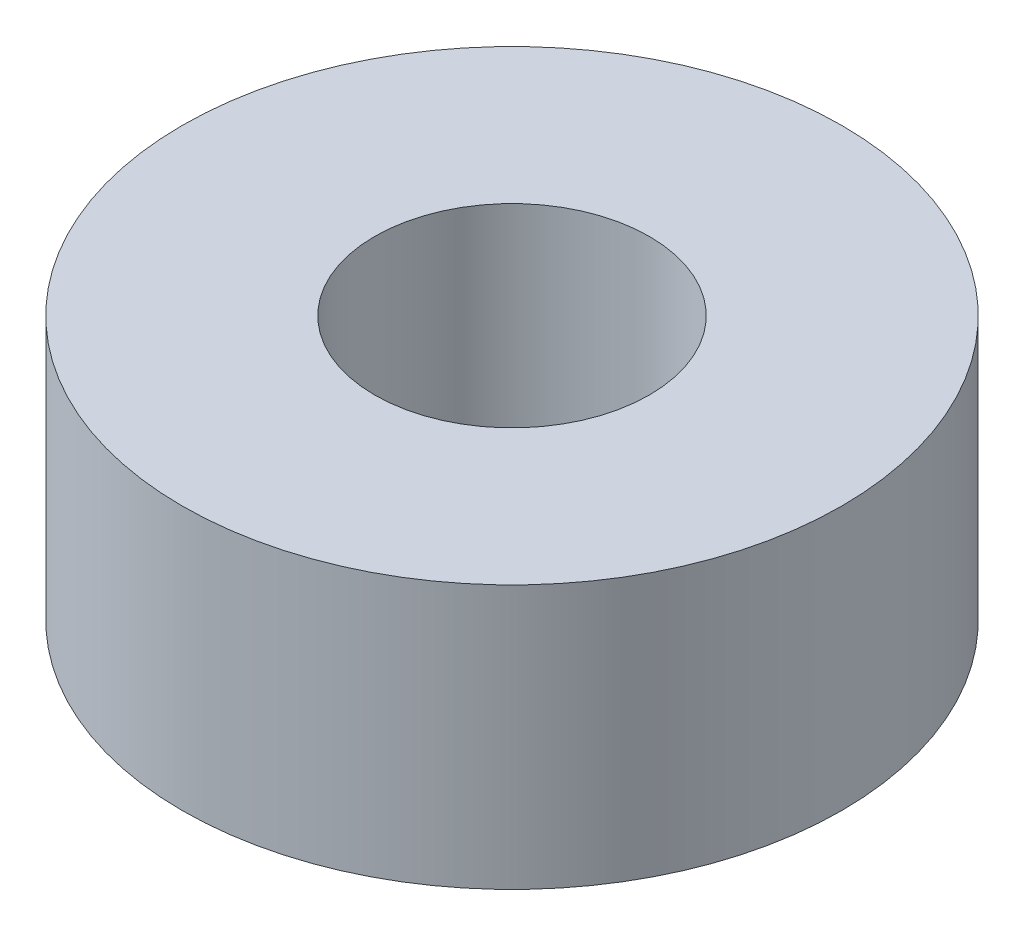
ISO-10303-21;
HEADER;
FILE_DESCRIPTION(('STEP AP214'),'2;1');
FILE_NAME('part.step','',(''),(''),'','','');
FILE_SCHEMA(('AUTOMOTIVE_DESIGN { 1 0 10303 214 1 1 1 1 }'));
ENDSEC;
DATA;
#1=APPLICATION_CONTEXT('core data for automotive mechanical design processes');
#2=APPLICATION_PROTOCOL_DEFINITION('international standard','automotive_design',2000,#1);
#3=PRODUCT_CONTEXT('',#1,'mechanical');
#4=PRODUCT('Part','Part','',(#3));
#5=PRODUCT_RELATED_PRODUCT_CATEGORY('part','',(#4));
#6=PRODUCT_DEFINITION_FORMATION('','',#4);
#7=PRODUCT_DEFINITION_CONTEXT('part definition',#1,'design');
#8=PRODUCT_DEFINITION('design','',#6,#7);
#9=PRODUCT_DEFINITION_SHAPE('','',#8);
#10=(LENGTH_UNIT() NAMED_UNIT(*) SI_UNIT(.MILLI.,.METRE.));
#11=(NAMED_UNIT(*) PLANE_ANGLE_UNIT() SI_UNIT($,.RADIAN.));
#12=(NAMED_UNIT(*) SI_UNIT($,.STERADIAN.) SOLID_ANGLE_UNIT());
#13=UNCERTAINTY_MEASURE_WITH_UNIT(LENGTH_MEASURE(1.E-05),#10,'distance_accuracy_value','');
#14=(GEOMETRIC_REPRESENTATION_CONTEXT(3) GLOBAL_UNCERTAINTY_ASSIGNED_CONTEXT((#13)) GLOBAL_UNIT_ASSIGNED_CONTEXT((#10,
#11,#12)) REPRESENTATION_CONTEXT('',''));
#15=CARTESIAN_POINT('',(0.,0.,0.));
#16=DIRECTION('',(0.,0.,1.));
#17=DIRECTION('',(1.,0.,0.));
#18=AXIS2_PLACEMENT_3D('',#15,#16,#17);
#19=CARTESIAN_POINT('',(0.,24.,0.));
#20=DIRECTION('',(0.,-1.,0.));
#21=DIRECTION('',(0.,0.,-1.));
#22=AXIS2_PLACEMENT_3D('',#19,#20,#21);
#23=CYLINDRICAL_SURFACE('',#22,30.);
#24=CARTESIAN_POINT('',(0.,24.,0.));
#25=DIRECTION('',(0.,1.,0.));
#26=DIRECTION('',(0.,0.,1.));
#27=AXIS2_PLACEMENT_3D('',#24,#25,#26);
#28=CIRCLE('',#27,30.);
#29=CARTESIAN_POINT('',(0.,24.,30.));
#30=VERTEX_POINT('',#29);
#31=EDGE_CURVE('E10',#30,#30,#28,.T.);
#32=ORIENTED_EDGE('',*,*,#31,.F.);
#33=EDGE_LOOP('',(#32));
#34=FACE_BOUND('',#33,.T.);
#35=CARTESIAN_POINT('',(0.,0.,0.));
#36=DIRECTION('',(0.,1.,0.));
#37=DIRECTION('',(0.,0.,1.));
#38=AXIS2_PLACEMENT_3D('',#35,#36,#37);
#39=CIRCLE('',#38,30.);
#40=CARTESIAN_POINT('',(0.,0.,30.));
#41=VERTEX_POINT('',#40);
#42=EDGE_CURVE('E37',#41,#41,#39,.T.);
#43=ORIENTED_EDGE('',*,*,#42,.T.);
#44=EDGE_LOOP('',(#43));
#45=FACE_BOUND('',#44,.T.);
#46=ADVANCED_FACE('F40',(#34,#45),#23,.T.);
#47=CARTESIAN_POINT('',(0.,24.,0.));
#48=DIRECTION('',(0.,1.,0.));
#49=DIRECTION('',(0.,0.,1.));
#50=AXIS2_PLACEMENT_3D('',#47,#48,#49);
#51=PLANE('',#50);
#52=CARTESIAN_POINT('',(0.,24.,0.));
#53=DIRECTION('',(0.,1.,0.));
#54=DIRECTION('',(0.,0.,1.));
#55=AXIS2_PLACEMENT_3D('',#52,#53,#54);
#56=CIRCLE('',#55,12.5);
#57=CARTESIAN_POINT('',(0.,24.,12.5));
#58=VERTEX_POINT('',#57);
#59=EDGE_CURVE('E50',#58,#58,#56,.T.);
#60=ORIENTED_EDGE('',*,*,#59,.F.);
#61=EDGE_LOOP('',(#60));
#62=FACE_BOUND('',#61,.T.);
#63=ORIENTED_EDGE('',*,*,#31,.T.);
#64=EDGE_LOOP('',(#63));
#65=FACE_BOUND('',#64,.T.);
#66=ADVANCED_FACE('F59',(#62,#65),#51,.T.);
#67=CARTESIAN_POINT('',(0.,0.,0.));
#68=DIRECTION('',(0.,1.,0.));
#69=DIRECTION('',(0.,0.,1.));
#70=AXIS2_PLACEMENT_3D('',#67,#68,#69);
#71=PLANE('',#70);
#72=CARTESIAN_POINT('',(0.,0.,0.));
#73=DIRECTION('',(0.,1.,0.));
#74=DIRECTION('',(0.,0.,1.));
#75=AXIS2_PLACEMENT_3D('',#72,#73,#74);
#76=CIRCLE('',#75,12.5);
#77=CARTESIAN_POINT('',(0.,0.,12.5));
#78=VERTEX_POINT('',#77);
#79=EDGE_CURVE('E47',#78,#78,#76,.T.);
#80=ORIENTED_EDGE('',*,*,#79,.T.);
#81=EDGE_LOOP('',(#80));
#82=FACE_BOUND('',#81,.T.);
#83=ORIENTED_EDGE('',*,*,#42,.F.);
#84=EDGE_LOOP('',(#83));
#85=FACE_BOUND('',#84,.T.);
#86=ADVANCED_FACE('F58',(#82,#85),#71,.F.);
#87=CARTESIAN_POINT('',(0.,24.,0.));
#88=DIRECTION('',(0.,-1.,0.));
#89=DIRECTION('',(0.,0.,-1.));
#90=AXIS2_PLACEMENT_3D('',#87,#88,#89);
#91=CYLINDRICAL_SURFACE('',#90,12.5);
#92=ORIENTED_EDGE('',*,*,#59,.T.);
#93=EDGE_LOOP('',(#92));
#94=FACE_BOUND('',#93,.T.);
#95=ORIENTED_EDGE('',*,*,#79,.F.);
#96=EDGE_LOOP('',(#95));
#97=FACE_BOUND('',#96,.T.);
#98=ADVANCED_FACE('F54',(#94,#97),#91,.F.);
#99=CLOSED_SHELL('',(#46,#66,#86,#98));
#100=MANIFOLD_SOLID_BREP('B2',#99);
#101=ADVANCED_BREP_SHAPE_REPRESENTATION('',(#18,#100),#14);
#102=SHAPE_DEFINITION_REPRESENTATION(#9,#101);
ENDSEC;
END-ISO-10303-21;
